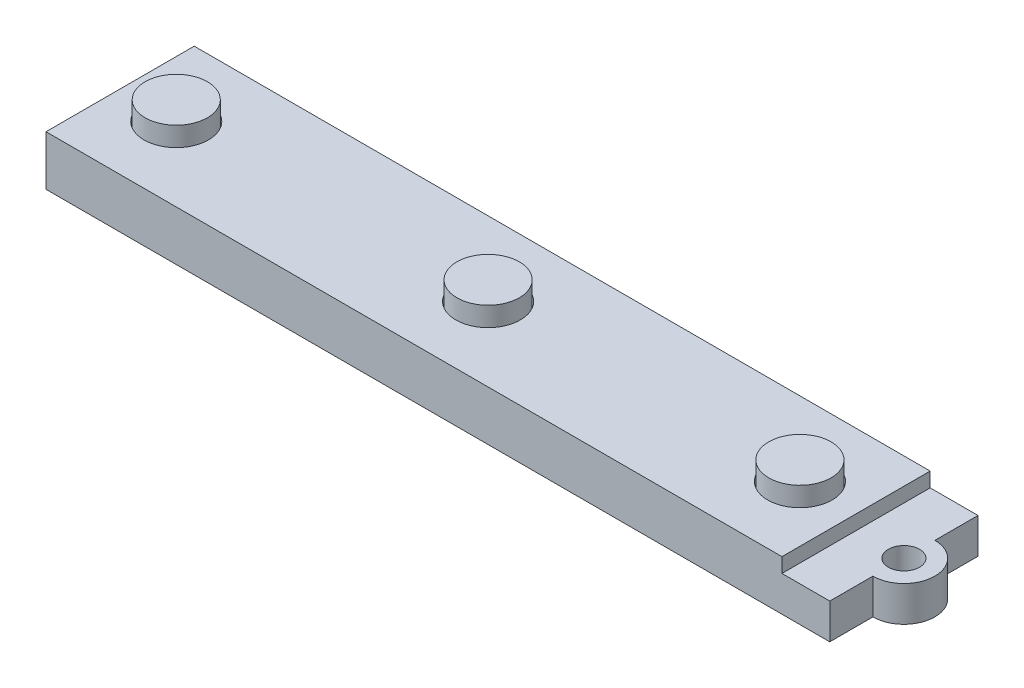
ISO-10303-21;
HEADER;
FILE_DESCRIPTION(('STEP AP214'),'2;1');
FILE_NAME('part.step','',(''),(''),'','','');
FILE_SCHEMA(('AUTOMOTIVE_DESIGN { 1 0 10303 214 1 1 1 1 }'));
ENDSEC;
DATA;
#1=APPLICATION_CONTEXT('core data for automotive mechanical design processes');
#2=APPLICATION_PROTOCOL_DEFINITION('international standard','automotive_design',2000,#1);
#3=PRODUCT_CONTEXT('',#1,'mechanical');
#4=PRODUCT('Part','Part','',(#3));
#5=PRODUCT_RELATED_PRODUCT_CATEGORY('part','',(#4));
#6=PRODUCT_DEFINITION_FORMATION('','',#4);
#7=PRODUCT_DEFINITION_CONTEXT('part definition',#1,'design');
#8=PRODUCT_DEFINITION('design','',#6,#7);
#9=PRODUCT_DEFINITION_SHAPE('','',#8);
#10=(LENGTH_UNIT() NAMED_UNIT(*) SI_UNIT(.MILLI.,.METRE.));
#11=(NAMED_UNIT(*) PLANE_ANGLE_UNIT() SI_UNIT($,.RADIAN.));
#12=(NAMED_UNIT(*) SI_UNIT($,.STERADIAN.) SOLID_ANGLE_UNIT());
#13=UNCERTAINTY_MEASURE_WITH_UNIT(LENGTH_MEASURE(1.E-05),#10,'distance_accuracy_value','');
#14=(GEOMETRIC_REPRESENTATION_CONTEXT(3) GLOBAL_UNCERTAINTY_ASSIGNED_CONTEXT((#13)) GLOBAL_UNIT_ASSIGNED_CONTEXT((#10,
#11,#12)) REPRESENTATION_CONTEXT('',''));
#15=CARTESIAN_POINT('',(0.,0.,0.));
#16=DIRECTION('',(0.,0.,1.));
#17=DIRECTION('',(1.,0.,0.));
#18=AXIS2_PLACEMENT_3D('',#15,#16,#17);
#19=CARTESIAN_POINT('',(0.,0.,0.));
#20=DIRECTION('',(0.,1.,0.));
#21=DIRECTION('',(0.,0.,1.));
#22=AXIS2_PLACEMENT_3D('',#19,#20,#21);
#23=PLANE('',#22);
#24=CARTESIAN_POINT('',(-20.4046666666667,0.,-25.8942737373737));
#25=DIRECTION('',(0.,1.,0.));
#26=DIRECTION('',(0.,0.,1.));
#27=AXIS2_PLACEMENT_3D('',#24,#25,#26);
#28=CIRCLE('',#27,1.905);
#29=CARTESIAN_POINT('',(-20.4046666666667,0.,-23.9892737373737));
#30=VERTEX_POINT('',#29);
#31=EDGE_CURVE('E212',#30,#30,#28,.T.);
#32=ORIENTED_EDGE('',*,*,#31,.T.);
#33=EDGE_LOOP('',(#32));
#34=FACE_BOUND('',#33,.T.);
#35=DIRECTION('',(0.,0.,-1.));
#36=VECTOR('',#35,1.);
#37=CARTESIAN_POINT('',(-112.479666666667,0.,-32.2442737373737));
#38=LINE('',#37,#36);
#39=CARTESIAN_POINT('',(-112.479666666667,0.,-19.5442737373737));
#40=VERTEX_POINT('',#39);
#41=CARTESIAN_POINT('',(-112.479666666667,0.,-32.2442737373737));
#42=VERTEX_POINT('',#41);
#43=EDGE_CURVE('E163',#40,#42,#38,.T.);
#44=ORIENTED_EDGE('',*,*,#43,.F.);
#45=DIRECTION('',(-1.,0.,0.));
#46=VECTOR('',#45,1.);
#47=CARTESIAN_POINT('',(-29.9296666666666,0.,-19.5442737373737));
#48=LINE('',#47,#46);
#49=CARTESIAN_POINT('',(-29.9296666666666,0.,-19.5442737373737));
#50=VERTEX_POINT('',#49);
#51=EDGE_CURVE('E168',#50,#40,#48,.T.);
#52=ORIENTED_EDGE('',*,*,#51,.F.);
#53=DIRECTION('',(0.,0.,1.));
#54=VECTOR('',#53,1.);
#55=CARTESIAN_POINT('',(-29.9296666666666,0.,-32.2442737373737));
#56=LINE('',#55,#54);
#57=CARTESIAN_POINT('',(-29.9296666666666,0.,-32.2442737373737));
#58=VERTEX_POINT('',#57);
#59=EDGE_CURVE('E178',#58,#50,#56,.T.);
#60=ORIENTED_EDGE('',*,*,#59,.F.);
#61=DIRECTION('',(1.,0.,0.));
#62=VECTOR('',#61,1.);
#63=CARTESIAN_POINT('',(-29.9296666666666,0.,-32.2442737373737));
#64=LINE('',#63,#62);
#65=EDGE_CURVE('E61',#42,#58,#64,.T.);
#66=ORIENTED_EDGE('',*,*,#65,.F.);
#67=EDGE_LOOP('',(#44,#52,#60,#66));
#68=FACE_BOUND('',#67,.T.);
#69=DIRECTION('',(-1.,0.,0.));
#70=VECTOR('',#69,1.);
#71=CARTESIAN_POINT('',(-116.162666666667,0.,-34.9493737373737));
#72=LINE('',#71,#70);
#73=CARTESIAN_POINT('',(-20.4046666666667,0.,-34.9493737373737));
#74=VERTEX_POINT('',#73);
#75=CARTESIAN_POINT('',(-116.162666666667,0.,-34.9493737373737));
#76=VERTEX_POINT('',#75);
#77=EDGE_CURVE('E234',#74,#76,#72,.T.);
#78=ORIENTED_EDGE('',*,*,#77,.F.);
#79=DIRECTION('',(0.,0.,1.));
#80=VECTOR('',#79,1.);
#81=CARTESIAN_POINT('',(-20.4046666666667,0.,0.));
#82=LINE('',#81,#80);
#83=CARTESIAN_POINT('',(-20.4046666666667,0.,-29.6800450522713));
#84=VERTEX_POINT('',#83);
#85=EDGE_CURVE('E160',#74,#84,#82,.T.);
#86=ORIENTED_EDGE('',*,*,#85,.T.);
#87=CARTESIAN_POINT('',(-20.4046666666667,0.,-25.8942737373737));
#88=DIRECTION('',(0.,1.,0.));
#89=DIRECTION('',(0.,0.,1.));
#90=AXIS2_PLACEMENT_3D('',#87,#88,#89);
#91=CIRCLE('',#90,3.78577131489756);
#92=CARTESIAN_POINT('',(-20.4046666666667,0.,-22.1085024224762));
#93=VERTEX_POINT('',#92);
#94=EDGE_CURVE('E156',#84,#93,#91,.F.);
#95=ORIENTED_EDGE('',*,*,#94,.T.);
#96=DIRECTION('',(0.,0.,1.));
#97=VECTOR('',#96,1.);
#98=CARTESIAN_POINT('',(-20.4046666666666,0.,0.));
#99=LINE('',#98,#97);
#100=CARTESIAN_POINT('',(-20.4046666666666,0.,-16.8391737373737));
#101=VERTEX_POINT('',#100);
#102=EDGE_CURVE('E134',#93,#101,#99,.T.);
#103=ORIENTED_EDGE('',*,*,#102,.T.);
#104=DIRECTION('',(1.,0.,0.));
#105=VECTOR('',#104,1.);
#106=CARTESIAN_POINT('',(-116.162666666667,0.,-16.8391737373737));
#107=LINE('',#106,#105);
#108=CARTESIAN_POINT('',(-116.162666666667,0.,-16.8391737373737));
#109=VERTEX_POINT('',#108);
#110=EDGE_CURVE('E241',#109,#101,#107,.T.);
#111=ORIENTED_EDGE('',*,*,#110,.F.);
#112=DIRECTION('',(0.,0.,1.));
#113=VECTOR('',#112,1.);
#114=CARTESIAN_POINT('',(-116.162666666667,0.,-34.9493737373737));
#115=LINE('',#114,#113);
#116=EDGE_CURVE('E227',#76,#109,#115,.T.);
#117=ORIENTED_EDGE('',*,*,#116,.F.);
#118=EDGE_LOOP('',(#78,#86,#95,#103,#111,#117));
#119=FACE_BOUND('',#118,.T.);
#120=ADVANCED_FACE('F38',(#34,#68,#119),#23,.F.);
#121=CARTESIAN_POINT('',(0.,4.318,0.));
#122=DIRECTION('',(0.,1.,0.));
#123=DIRECTION('',(0.,0.,1.));
#124=AXIS2_PLACEMENT_3D('',#121,#122,#123);
#125=PLANE('',#124);
#126=CARTESIAN_POINT('',(-20.4046666666667,4.318,-25.8942737373737));
#127=DIRECTION('',(0.,1.,0.));
#128=DIRECTION('',(0.,0.,1.));
#129=AXIS2_PLACEMENT_3D('',#126,#127,#128);
#130=CIRCLE('',#129,1.905);
#131=CARTESIAN_POINT('',(-20.4046666666667,4.318,-23.9892737373737));
#132=VERTEX_POINT('',#131);
#133=EDGE_CURVE('E209',#132,#132,#130,.T.);
#134=ORIENTED_EDGE('',*,*,#133,.F.);
#135=EDGE_LOOP('',(#134));
#136=FACE_BOUND('',#135,.T.);
#137=DIRECTION('',(0.,0.,1.));
#138=VECTOR('',#137,1.);
#139=CARTESIAN_POINT('',(-20.4046666666667,4.318,-34.9493737373737));
#140=LINE('',#139,#138);
#141=CARTESIAN_POINT('',(-20.4046666666667,4.318,-34.9493737373737));
#142=VERTEX_POINT('',#141);
#143=CARTESIAN_POINT('',(-20.4046666666667,4.318,-29.6800450522713));
#144=VERTEX_POINT('',#143);
#145=EDGE_CURVE('E53',#142,#144,#140,.T.);
#146=ORIENTED_EDGE('',*,*,#145,.F.);
#147=DIRECTION('',(-1.,0.,0.));
#148=VECTOR('',#147,1.);
#149=CARTESIAN_POINT('',(-26.2466666666667,4.318,-34.9493737373737));
#150=LINE('',#149,#148);
#151=CARTESIAN_POINT('',(-26.2466666666667,4.318,-34.9493737373737));
#152=VERTEX_POINT('',#151);
#153=EDGE_CURVE('E221',#142,#152,#150,.T.);
#154=ORIENTED_EDGE('',*,*,#153,.T.);
#155=DIRECTION('',(0.,0.,1.));
#156=VECTOR('',#155,1.);
#157=CARTESIAN_POINT('',(-26.2466666666667,4.318,-34.9493737373737));
#158=LINE('',#157,#156);
#159=CARTESIAN_POINT('',(-26.2466666666667,4.318,-16.8391737373737));
#160=VERTEX_POINT('',#159);
#161=EDGE_CURVE('E218',#152,#160,#158,.T.);
#162=ORIENTED_EDGE('',*,*,#161,.T.);
#163=DIRECTION('',(1.,0.,0.));
#164=VECTOR('',#163,1.);
#165=CARTESIAN_POINT('',(-26.2466666666667,4.318,-16.8391737373737));
#166=LINE('',#165,#164);
#167=CARTESIAN_POINT('',(-20.4046666666666,4.318,-16.8391737373737));
#168=VERTEX_POINT('',#167);
#169=EDGE_CURVE('E149',#160,#168,#166,.T.);
#170=ORIENTED_EDGE('',*,*,#169,.T.);
#171=DIRECTION('',(0.,0.,1.));
#172=VECTOR('',#171,1.);
#173=CARTESIAN_POINT('',(-20.4046666666667,4.318,-22.1085024224762));
#174=LINE('',#173,#172);
#175=CARTESIAN_POINT('',(-20.4046666666667,4.318,-22.1085024224762));
#176=VERTEX_POINT('',#175);
#177=EDGE_CURVE('E131',#176,#168,#174,.T.);
#178=ORIENTED_EDGE('',*,*,#177,.F.);
#179=CARTESIAN_POINT('',(-20.4046666666667,4.318,-25.8942737373737));
#180=DIRECTION('',(0.,-1.,0.));
#181=DIRECTION('',(0.,0.,1.));
#182=AXIS2_PLACEMENT_3D('',#179,#180,#181);
#183=CIRCLE('',#182,3.78577131489756);
#184=EDGE_CURVE('E141',#144,#176,#183,.T.);
#185=ORIENTED_EDGE('',*,*,#184,.F.);
#186=EDGE_LOOP('',(#146,#154,#162,#170,#178,#185));
#187=FACE_BOUND('',#186,.T.);
#188=ADVANCED_FACE('F146',(#136,#187),#125,.T.);
#189=CARTESIAN_POINT('',(-116.162666666667,6.096,-34.9493737373737));
#190=DIRECTION('',(1.,0.,0.));
#191=DIRECTION('',(0.,0.,-1.));
#192=AXIS2_PLACEMENT_3D('',#189,#190,#191);
#193=PLANE('',#192);
#194=ORIENTED_EDGE('',*,*,#116,.T.);
#195=DIRECTION('',(0.,-1.,0.));
#196=VECTOR('',#195,1.);
#197=CARTESIAN_POINT('',(-116.162666666667,6.096,-16.8391737373737));
#198=LINE('',#197,#196);
#199=CARTESIAN_POINT('',(-116.162666666667,6.096,-16.8391737373737));
#200=VERTEX_POINT('',#199);
#201=EDGE_CURVE('E11',#200,#109,#198,.T.);
#202=ORIENTED_EDGE('',*,*,#201,.F.);
#203=DIRECTION('',(0.,0.,1.));
#204=VECTOR('',#203,1.);
#205=CARTESIAN_POINT('',(-116.162666666667,6.096,-34.9493737373737));
#206=LINE('',#205,#204);
#207=CARTESIAN_POINT('',(-116.162666666667,6.096,-34.9493737373737));
#208=VERTEX_POINT('',#207);
#209=EDGE_CURVE('E230',#208,#200,#206,.T.);
#210=ORIENTED_EDGE('',*,*,#209,.F.);
#211=DIRECTION('',(0.,-1.,0.));
#212=VECTOR('',#211,1.);
#213=CARTESIAN_POINT('',(-116.162666666667,6.096,-34.9493737373737));
#214=LINE('',#213,#212);
#215=EDGE_CURVE('E46',#208,#76,#214,.T.);
#216=ORIENTED_EDGE('',*,*,#215,.T.);
#217=EDGE_LOOP('',(#194,#202,#210,#216));
#218=FACE_BOUND('',#217,.T.);
#219=ADVANCED_FACE('F40',(#218),#193,.F.);
#220=CARTESIAN_POINT('',(-116.162666666667,6.096,-16.8391737373737));
#221=DIRECTION('',(0.,0.,-1.));
#222=DIRECTION('',(-1.,0.,0.));
#223=AXIS2_PLACEMENT_3D('',#220,#221,#222);
#224=PLANE('',#223);
#225=ORIENTED_EDGE('',*,*,#110,.T.);
#226=DIRECTION('',(0.,1.,0.));
#227=VECTOR('',#226,1.);
#228=CARTESIAN_POINT('',(-20.4046666666666,-1.27,-16.8391737373737));
#229=LINE('',#228,#227);
#230=EDGE_CURVE('E137',#101,#168,#229,.T.);
#231=ORIENTED_EDGE('',*,*,#230,.T.);
#232=ORIENTED_EDGE('',*,*,#169,.F.);
#233=DIRECTION('',(0.,1.,0.));
#234=VECTOR('',#233,1.);
#235=CARTESIAN_POINT('',(-26.2466666666667,4.318,-16.8391737373737));
#236=LINE('',#235,#234);
#237=CARTESIAN_POINT('',(-26.2466666666667,6.096,-16.8391737373737));
#238=VERTEX_POINT('',#237);
#239=EDGE_CURVE('E223',#160,#238,#236,.T.);
#240=ORIENTED_EDGE('',*,*,#239,.T.);
#241=DIRECTION('',(1.,0.,0.));
#242=VECTOR('',#241,1.);
#243=CARTESIAN_POINT('',(-116.162666666667,6.096,-16.8391737373737));
#244=LINE('',#243,#242);
#245=EDGE_CURVE('E233',#200,#238,#244,.T.);
#246=ORIENTED_EDGE('',*,*,#245,.F.);
#247=ORIENTED_EDGE('',*,*,#201,.T.);
#248=EDGE_LOOP('',(#225,#231,#232,#240,#246,#247));
#249=FACE_BOUND('',#248,.T.);
#250=ADVANCED_FACE('F255',(#249),#224,.F.);
#251=CARTESIAN_POINT('',(-116.162666666667,6.096,-34.9493737373737));
#252=DIRECTION('',(0.,0.,1.));
#253=DIRECTION('',(1.,0.,0.));
#254=AXIS2_PLACEMENT_3D('',#251,#252,#253);
#255=PLANE('',#254);
#256=ORIENTED_EDGE('',*,*,#153,.F.);
#257=DIRECTION('',(0.,1.,0.));
#258=VECTOR('',#257,1.);
#259=CARTESIAN_POINT('',(-20.4046666666667,-1.27,-34.9493737373737));
#260=LINE('',#259,#258);
#261=EDGE_CURVE('E154',#74,#142,#260,.T.);
#262=ORIENTED_EDGE('',*,*,#261,.F.);
#263=ORIENTED_EDGE('',*,*,#77,.T.);
#264=ORIENTED_EDGE('',*,*,#215,.F.);
#265=DIRECTION('',(-1.,0.,0.));
#266=VECTOR('',#265,1.);
#267=CARTESIAN_POINT('',(-116.162666666667,6.096,-34.9493737373737));
#268=LINE('',#267,#266);
#269=CARTESIAN_POINT('',(-26.2466666666667,6.096,-34.9493737373737));
#270=VERTEX_POINT('',#269);
#271=EDGE_CURVE('E237',#270,#208,#268,.T.);
#272=ORIENTED_EDGE('',*,*,#271,.F.);
#273=DIRECTION('',(0.,1.,0.));
#274=VECTOR('',#273,1.);
#275=CARTESIAN_POINT('',(-26.2466666666667,4.318,-34.9493737373737));
#276=LINE('',#275,#274);
#277=EDGE_CURVE('E225',#152,#270,#276,.T.);
#278=ORIENTED_EDGE('',*,*,#277,.F.);
#279=EDGE_LOOP('',(#256,#262,#263,#264,#272,#278));
#280=FACE_BOUND('',#279,.T.);
#281=ADVANCED_FACE('F261',(#280),#255,.F.);
#282=CARTESIAN_POINT('',(0.,6.096,0.));
#283=DIRECTION('',(0.,1.,0.));
#284=DIRECTION('',(0.,0.,1.));
#285=AXIS2_PLACEMENT_3D('',#282,#283,#284);
#286=PLANE('',#285);
#287=CARTESIAN_POINT('',(-71.2046666666667,6.096,-25.8942737373734));
#288=DIRECTION('',(0.,1.,0.));
#289=DIRECTION('',(0.,0.,1.));
#290=AXIS2_PLACEMENT_3D('',#287,#288,#289);
#291=CIRCLE('',#290,3.937);
#292=CARTESIAN_POINT('',(-71.2046666666667,6.096,-21.9572737373734));
#293=VERTEX_POINT('',#292);
#294=EDGE_CURVE('E198',#293,#293,#291,.T.);
#295=ORIENTED_EDGE('',*,*,#294,.F.);
#296=EDGE_LOOP('',(#295));
#297=FACE_BOUND('',#296,.T.);
#298=CARTESIAN_POINT('',(-109.304666666667,6.096,-25.8942737373732));
#299=DIRECTION('',(0.,1.,0.));
#300=DIRECTION('',(0.,0.,1.));
#301=AXIS2_PLACEMENT_3D('',#298,#299,#300);
#302=CIRCLE('',#301,3.937);
#303=CARTESIAN_POINT('',(-109.304666666667,6.096,-21.9572737373732));
#304=VERTEX_POINT('',#303);
#305=EDGE_CURVE('E193',#304,#304,#302,.T.);
#306=ORIENTED_EDGE('',*,*,#305,.F.);
#307=EDGE_LOOP('',(#306));
#308=FACE_BOUND('',#307,.T.);
#309=CARTESIAN_POINT('',(-33.1046666666667,6.096,-25.8942737373737));
#310=DIRECTION('',(0.,1.,0.));
#311=DIRECTION('',(0.,0.,1.));
#312=AXIS2_PLACEMENT_3D('',#309,#310,#311);
#313=CIRCLE('',#312,3.937);
#314=CARTESIAN_POINT('',(-33.1046666666667,6.096,-21.9572737373737));
#315=VERTEX_POINT('',#314);
#316=EDGE_CURVE('E197',#315,#315,#313,.T.);
#317=ORIENTED_EDGE('',*,*,#316,.F.);
#318=EDGE_LOOP('',(#317));
#319=FACE_BOUND('',#318,.T.);
#320=DIRECTION('',(0.,0.,1.));
#321=VECTOR('',#320,1.);
#322=CARTESIAN_POINT('',(-26.2466666666667,6.096,-34.9493737373737));
#323=LINE('',#322,#321);
#324=EDGE_CURVE('E215',#270,#238,#323,.T.);
#325=ORIENTED_EDGE('',*,*,#324,.F.);
#326=ORIENTED_EDGE('',*,*,#271,.T.);
#327=ORIENTED_EDGE('',*,*,#209,.T.);
#328=ORIENTED_EDGE('',*,*,#245,.T.);
#329=EDGE_LOOP('',(#325,#326,#327,#328));
#330=FACE_BOUND('',#329,.T.);
#331=ADVANCED_FACE('F258',(#297,#308,#319,#330),#286,.T.);
#332=CARTESIAN_POINT('',(-26.2466666666667,4.318,-34.9493737373737));
#333=DIRECTION('',(-1.,0.,0.));
#334=DIRECTION('',(0.,0.,1.));
#335=AXIS2_PLACEMENT_3D('',#332,#333,#334);
#336=PLANE('',#335);
#337=ORIENTED_EDGE('',*,*,#324,.T.);
#338=ORIENTED_EDGE('',*,*,#239,.F.);
#339=ORIENTED_EDGE('',*,*,#161,.F.);
#340=ORIENTED_EDGE('',*,*,#277,.T.);
#341=EDGE_LOOP('',(#337,#338,#339,#340));
#342=FACE_BOUND('',#341,.T.);
#343=ADVANCED_FACE('F265',(#342),#336,.F.);
#344=CARTESIAN_POINT('',(-20.4046666666667,0.,-25.8942737373737));
#345=DIRECTION('',(0.,1.,0.));
#346=DIRECTION('',(0.,0.,1.));
#347=AXIS2_PLACEMENT_3D('',#344,#345,#346);
#348=CYLINDRICAL_SURFACE('',#347,1.905);
#349=ORIENTED_EDGE('',*,*,#31,.F.);
#350=EDGE_LOOP('',(#349));
#351=FACE_BOUND('',#350,.T.);
#352=ORIENTED_EDGE('',*,*,#133,.T.);
#353=EDGE_LOOP('',(#352));
#354=FACE_BOUND('',#353,.T.);
#355=ADVANCED_FACE('F317',(#351,#354),#348,.F.);
#356=CARTESIAN_POINT('',(-33.1046666666667,4.826,-25.8942737373737));
#357=DIRECTION('',(0.,1.,0.));
#358=DIRECTION('',(0.,0.,1.));
#359=AXIS2_PLACEMENT_3D('',#356,#357,#358);
#360=CYLINDRICAL_SURFACE('',#359,3.937);
#361=CARTESIAN_POINT('',(-33.1046666666667,4.826,-25.8942737373737));
#362=DIRECTION('',(0.,1.,0.));
#363=DIRECTION('',(0.,0.,1.));
#364=AXIS2_PLACEMENT_3D('',#361,#362,#363);
#365=CIRCLE('',#364,3.937);
#366=CARTESIAN_POINT('',(-33.1046666666667,4.826,-21.9572737373737));
#367=VERTEX_POINT('',#366);
#368=EDGE_CURVE('E206',#367,#367,#365,.T.);
#369=ORIENTED_EDGE('',*,*,#368,.F.);
#370=EDGE_LOOP('',(#369));
#371=FACE_BOUND('',#370,.T.);
#372=ORIENTED_EDGE('',*,*,#316,.T.);
#373=EDGE_LOOP('',(#372));
#374=FACE_BOUND('',#373,.T.);
#375=ADVANCED_FACE('F315',(#371,#374),#360,.F.);
#376=CARTESIAN_POINT('',(-33.1046666666667,4.826,-25.8942737373737));
#377=DIRECTION('',(0.,1.,0.));
#378=DIRECTION('',(0.,0.,1.));
#379=AXIS2_PLACEMENT_3D('',#376,#377,#378);
#380=PLANE('',#379);
#381=CARTESIAN_POINT('',(-33.1046666666667,4.826,-25.8942737373737));
#382=DIRECTION('',(0.,1.,0.));
#383=DIRECTION('',(0.,0.,1.));
#384=AXIS2_PLACEMENT_3D('',#381,#382,#383);
#385=CIRCLE('',#384,3.81);
#386=CARTESIAN_POINT('',(-33.1046666666667,4.826,-22.0842737373737));
#387=VERTEX_POINT('',#386);
#388=EDGE_CURVE('E268',#387,#387,#385,.T.);
#389=ORIENTED_EDGE('',*,*,#388,.F.);
#390=EDGE_LOOP('',(#389));
#391=FACE_BOUND('',#390,.T.);
#392=ORIENTED_EDGE('',*,*,#368,.T.);
#393=EDGE_LOOP('',(#392));
#394=FACE_BOUND('',#393,.T.);
#395=ADVANCED_FACE('F305',(#391,#394),#380,.T.);
#396=CARTESIAN_POINT('',(-109.304666666667,4.826,-25.8942737373732));
#397=DIRECTION('',(0.,1.,0.));
#398=DIRECTION('',(0.,0.,1.));
#399=AXIS2_PLACEMENT_3D('',#396,#397,#398);
#400=CYLINDRICAL_SURFACE('',#399,3.937);
#401=CARTESIAN_POINT('',(-109.304666666667,4.826,-25.8942737373732));
#402=DIRECTION('',(0.,1.,0.));
#403=DIRECTION('',(0.,0.,1.));
#404=AXIS2_PLACEMENT_3D('',#401,#402,#403);
#405=CIRCLE('',#404,3.937);
#406=CARTESIAN_POINT('',(-109.304666666667,4.826,-21.9572737373732));
#407=VERTEX_POINT('',#406);
#408=EDGE_CURVE('E201',#407,#407,#405,.T.);
#409=ORIENTED_EDGE('',*,*,#408,.F.);
#410=EDGE_LOOP('',(#409));
#411=FACE_BOUND('',#410,.T.);
#412=ORIENTED_EDGE('',*,*,#305,.T.);
#413=EDGE_LOOP('',(#412));
#414=FACE_BOUND('',#413,.T.);
#415=ADVANCED_FACE('F299',(#411,#414),#400,.F.);
#416=CARTESIAN_POINT('',(-109.304666666667,4.826,-25.8942737373732));
#417=DIRECTION('',(0.,1.,0.));
#418=DIRECTION('',(0.,0.,1.));
#419=AXIS2_PLACEMENT_3D('',#416,#417,#418);
#420=PLANE('',#419);
#421=CARTESIAN_POINT('',(-109.304666666667,4.826,-25.8942737373732));
#422=DIRECTION('',(0.,1.,0.));
#423=DIRECTION('',(0.,0.,1.));
#424=AXIS2_PLACEMENT_3D('',#421,#422,#423);
#425=CIRCLE('',#424,3.81);
#426=CARTESIAN_POINT('',(-109.304666666667,4.826,-22.0842737373732));
#427=VERTEX_POINT('',#426);
#428=EDGE_CURVE('E280',#427,#427,#425,.T.);
#429=ORIENTED_EDGE('',*,*,#428,.F.);
#430=EDGE_LOOP('',(#429));
#431=FACE_BOUND('',#430,.T.);
#432=ORIENTED_EDGE('',*,*,#408,.T.);
#433=EDGE_LOOP('',(#432));
#434=FACE_BOUND('',#433,.T.);
#435=ADVANCED_FACE('F295',(#431,#434),#420,.T.);
#436=CARTESIAN_POINT('',(-71.2046666666667,4.826,-25.8942737373734));
#437=DIRECTION('',(0.,1.,0.));
#438=DIRECTION('',(0.,0.,1.));
#439=AXIS2_PLACEMENT_3D('',#436,#437,#438);
#440=CYLINDRICAL_SURFACE('',#439,3.937);
#441=CARTESIAN_POINT('',(-71.2046666666667,4.826,-25.8942737373734));
#442=DIRECTION('',(0.,1.,0.));
#443=DIRECTION('',(0.,0.,1.));
#444=AXIS2_PLACEMENT_3D('',#441,#442,#443);
#445=CIRCLE('',#444,3.937);
#446=CARTESIAN_POINT('',(-71.2046666666667,4.826,-21.9572737373734));
#447=VERTEX_POINT('',#446);
#448=EDGE_CURVE('E194',#447,#447,#445,.T.);
#449=ORIENTED_EDGE('',*,*,#448,.F.);
#450=EDGE_LOOP('',(#449));
#451=FACE_BOUND('',#450,.T.);
#452=ORIENTED_EDGE('',*,*,#294,.T.);
#453=EDGE_LOOP('',(#452));
#454=FACE_BOUND('',#453,.T.);
#455=ADVANCED_FACE('F298',(#451,#454),#440,.F.);
#456=CARTESIAN_POINT('',(-71.2046666666667,4.826,-25.8942737373734));
#457=DIRECTION('',(0.,1.,0.));
#458=DIRECTION('',(0.,0.,1.));
#459=AXIS2_PLACEMENT_3D('',#456,#457,#458);
#460=PLANE('',#459);
#461=CARTESIAN_POINT('',(-71.2046666666667,4.826,-25.8942737373734));
#462=DIRECTION('',(0.,1.,0.));
#463=DIRECTION('',(0.,0.,1.));
#464=AXIS2_PLACEMENT_3D('',#461,#462,#463);
#465=CIRCLE('',#464,3.81000000000001);
#466=CARTESIAN_POINT('',(-71.2046666666667,4.826,-22.0842737373734));
#467=VERTEX_POINT('',#466);
#468=EDGE_CURVE('E274',#467,#467,#465,.T.);
#469=ORIENTED_EDGE('',*,*,#468,.F.);
#470=EDGE_LOOP('',(#469));
#471=FACE_BOUND('',#470,.T.);
#472=ORIENTED_EDGE('',*,*,#448,.T.);
#473=EDGE_LOOP('',(#472));
#474=FACE_BOUND('',#473,.T.);
#475=ADVANCED_FACE('F415',(#471,#474),#460,.T.);
#476=CARTESIAN_POINT('',(-112.479666666667,-1.27,-32.2442737373737));
#477=DIRECTION('',(1.,0.,0.));
#478=DIRECTION('',(0.,0.,-1.));
#479=AXIS2_PLACEMENT_3D('',#476,#477,#478);
#480=PLANE('',#479);
#481=ORIENTED_EDGE('',*,*,#43,.T.);
#482=DIRECTION('',(0.,1.,0.));
#483=VECTOR('',#482,1.);
#484=CARTESIAN_POINT('',(-112.479666666667,-1.27,-32.2442737373737));
#485=LINE('',#484,#483);
#486=CARTESIAN_POINT('',(-112.479666666667,-1.27,-32.2442737373737));
#487=VERTEX_POINT('',#486);
#488=EDGE_CURVE('E191',#487,#42,#485,.T.);
#489=ORIENTED_EDGE('',*,*,#488,.F.);
#490=DIRECTION('',(0.,0.,-1.));
#491=VECTOR('',#490,1.);
#492=CARTESIAN_POINT('',(-112.479666666667,-1.27,-32.2442737373737));
#493=LINE('',#492,#491);
#494=CARTESIAN_POINT('',(-112.479666666667,-1.27,-19.5442737373737));
#495=VERTEX_POINT('',#494);
#496=EDGE_CURVE('E164',#495,#487,#493,.T.);
#497=ORIENTED_EDGE('',*,*,#496,.F.);
#498=DIRECTION('',(0.,1.,0.));
#499=VECTOR('',#498,1.);
#500=CARTESIAN_POINT('',(-112.479666666667,-1.27,-19.5442737373737));
#501=LINE('',#500,#499);
#502=EDGE_CURVE('E174',#495,#40,#501,.T.);
#503=ORIENTED_EDGE('',*,*,#502,.T.);
#504=EDGE_LOOP('',(#481,#489,#497,#503));
#505=FACE_BOUND('',#504,.T.);
#506=ADVANCED_FACE('F404',(#505),#480,.F.);
#507=CARTESIAN_POINT('',(-29.9296666666666,-1.27,-32.2442737373737));
#508=DIRECTION('',(0.,0.,1.));
#509=DIRECTION('',(1.,0.,0.));
#510=AXIS2_PLACEMENT_3D('',#507,#508,#509);
#511=PLANE('',#510);
#512=ORIENTED_EDGE('',*,*,#65,.T.);
#513=DIRECTION('',(0.,1.,0.));
#514=VECTOR('',#513,1.);
#515=CARTESIAN_POINT('',(-29.9296666666666,-1.27,-32.2442737373737));
#516=LINE('',#515,#514);
#517=CARTESIAN_POINT('',(-29.9296666666666,-1.27,-32.2442737373737));
#518=VERTEX_POINT('',#517);
#519=EDGE_CURVE('E188',#518,#58,#516,.T.);
#520=ORIENTED_EDGE('',*,*,#519,.F.);
#521=DIRECTION('',(1.,0.,0.));
#522=VECTOR('',#521,1.);
#523=CARTESIAN_POINT('',(-29.9296666666666,-1.27,-32.2442737373737));
#524=LINE('',#523,#522);
#525=EDGE_CURVE('E167',#487,#518,#524,.T.);
#526=ORIENTED_EDGE('',*,*,#525,.F.);
#527=ORIENTED_EDGE('',*,*,#488,.T.);
#528=EDGE_LOOP('',(#512,#520,#526,#527));
#529=FACE_BOUND('',#528,.T.);
#530=ADVANCED_FACE('F393',(#529),#511,.F.);
#531=CARTESIAN_POINT('',(-29.9296666666666,-1.27,-32.2442737373737));
#532=DIRECTION('',(-1.,0.,0.));
#533=DIRECTION('',(0.,0.,1.));
#534=AXIS2_PLACEMENT_3D('',#531,#532,#533);
#535=PLANE('',#534);
#536=ORIENTED_EDGE('',*,*,#59,.T.);
#537=DIRECTION('',(0.,1.,0.));
#538=VECTOR('',#537,1.);
#539=CARTESIAN_POINT('',(-29.9296666666666,-1.27,-19.5442737373737));
#540=LINE('',#539,#538);
#541=CARTESIAN_POINT('',(-29.9296666666666,-1.27,-19.5442737373737));
#542=VERTEX_POINT('',#541);
#543=EDGE_CURVE('E185',#542,#50,#540,.T.);
#544=ORIENTED_EDGE('',*,*,#543,.F.);
#545=DIRECTION('',(0.,0.,1.));
#546=VECTOR('',#545,1.);
#547=CARTESIAN_POINT('',(-29.9296666666666,-1.27,-32.2442737373737));
#548=LINE('',#547,#546);
#549=EDGE_CURVE('E170',#518,#542,#548,.T.);
#550=ORIENTED_EDGE('',*,*,#549,.F.);
#551=ORIENTED_EDGE('',*,*,#519,.T.);
#552=EDGE_LOOP('',(#536,#544,#550,#551));
#553=FACE_BOUND('',#552,.T.);
#554=ADVANCED_FACE('F382',(#553),#535,.F.);
#555=CARTESIAN_POINT('',(-29.9296666666666,-1.27,-19.5442737373737));
#556=DIRECTION('',(0.,0.,-1.));
#557=DIRECTION('',(-1.,0.,0.));
#558=AXIS2_PLACEMENT_3D('',#555,#556,#557);
#559=PLANE('',#558);
#560=ORIENTED_EDGE('',*,*,#51,.T.);
#561=ORIENTED_EDGE('',*,*,#502,.F.);
#562=DIRECTION('',(-1.,0.,0.));
#563=VECTOR('',#562,1.);
#564=CARTESIAN_POINT('',(-29.9296666666666,-1.27,-19.5442737373737));
#565=LINE('',#564,#563);
#566=EDGE_CURVE('E172',#542,#495,#565,.T.);
#567=ORIENTED_EDGE('',*,*,#566,.F.);
#568=ORIENTED_EDGE('',*,*,#543,.T.);
#569=EDGE_LOOP('',(#560,#561,#567,#568));
#570=FACE_BOUND('',#569,.T.);
#571=ADVANCED_FACE('F370',(#570),#559,.F.);
#572=CARTESIAN_POINT('',(0.,-1.27,0.));
#573=DIRECTION('',(0.,-1.,0.));
#574=DIRECTION('',(0.,0.,-1.));
#575=AXIS2_PLACEMENT_3D('',#572,#573,#574);
#576=PLANE('',#575);
#577=ORIENTED_EDGE('',*,*,#496,.T.);
#578=ORIENTED_EDGE('',*,*,#525,.T.);
#579=ORIENTED_EDGE('',*,*,#549,.T.);
#580=ORIENTED_EDGE('',*,*,#566,.T.);
#581=EDGE_LOOP('',(#577,#578,#579,#580));
#582=FACE_BOUND('',#581,.T.);
#583=ADVANCED_FACE('F363',(#582),#576,.T.);
#584=CARTESIAN_POINT('',(-20.4046666666667,-1.27,-34.9493737373737));
#585=DIRECTION('',(-1.,0.,0.));
#586=DIRECTION('',(0.,0.,1.));
#587=AXIS2_PLACEMENT_3D('',#584,#585,#586);
#588=PLANE('',#587);
#589=ORIENTED_EDGE('',*,*,#261,.T.);
#590=ORIENTED_EDGE('',*,*,#145,.T.);
#591=DIRECTION('',(0.,1.,0.));
#592=VECTOR('',#591,1.);
#593=CARTESIAN_POINT('',(-20.4046666666667,-1.27,-29.6800450522713));
#594=LINE('',#593,#592);
#595=EDGE_CURVE('E138',#84,#144,#594,.T.);
#596=ORIENTED_EDGE('',*,*,#595,.F.);
#597=ORIENTED_EDGE('',*,*,#85,.F.);
#598=EDGE_LOOP('',(#589,#590,#596,#597));
#599=FACE_BOUND('',#598,.T.);
#600=ADVANCED_FACE('F369',(#599),#588,.F.);
#601=CARTESIAN_POINT('',(-20.4046666666667,-1.27,-22.1085024224762));
#602=DIRECTION('',(-1.,0.,0.));
#603=DIRECTION('',(0.,0.,1.));
#604=AXIS2_PLACEMENT_3D('',#601,#602,#603);
#605=PLANE('',#604);
#606=DIRECTION('',(0.,1.,0.));
#607=VECTOR('',#606,1.);
#608=CARTESIAN_POINT('',(-20.4046666666667,-1.27,-22.1085024224762));
#609=LINE('',#608,#607);
#610=EDGE_CURVE('E127',#93,#176,#609,.T.);
#611=ORIENTED_EDGE('',*,*,#610,.T.);
#612=ORIENTED_EDGE('',*,*,#177,.T.);
#613=ORIENTED_EDGE('',*,*,#230,.F.);
#614=ORIENTED_EDGE('',*,*,#102,.F.);
#615=EDGE_LOOP('',(#611,#612,#613,#614));
#616=FACE_BOUND('',#615,.T.);
#617=ADVANCED_FACE('F129',(#616),#605,.F.);
#618=CARTESIAN_POINT('',(-20.4046666666667,-1.27,-25.8942737373737));
#619=DIRECTION('',(0.,1.,0.));
#620=DIRECTION('',(0.,0.,1.));
#621=AXIS2_PLACEMENT_3D('',#618,#619,#620);
#622=CYLINDRICAL_SURFACE('',#621,3.78577131489756);
#623=ORIENTED_EDGE('',*,*,#595,.T.);
#624=ORIENTED_EDGE('',*,*,#184,.T.);
#625=ORIENTED_EDGE('',*,*,#610,.F.);
#626=ORIENTED_EDGE('',*,*,#94,.F.);
#627=EDGE_LOOP('',(#623,#624,#625,#626));
#628=FACE_BOUND('',#627,.T.);
#629=ADVANCED_FACE('F142',(#628),#622,.T.);
#630=CARTESIAN_POINT('',(-33.1046666666667,8.382,-25.8942737373737));
#631=DIRECTION('',(0.,-1.,0.));
#632=DIRECTION('',(0.,0.,-1.));
#633=AXIS2_PLACEMENT_3D('',#630,#631,#632);
#634=CYLINDRICAL_SURFACE('',#633,3.81);
#635=CARTESIAN_POINT('',(-33.1046666666667,8.382,-25.8942737373737));
#636=DIRECTION('',(0.,1.,0.));
#637=DIRECTION('',(0.,0.,1.));
#638=AXIS2_PLACEMENT_3D('',#635,#636,#637);
#639=CIRCLE('',#638,3.81);
#640=CARTESIAN_POINT('',(-33.1046666666667,8.382,-22.0842737373737));
#641=VERTEX_POINT('',#640);
#642=EDGE_CURVE('E266',#641,#641,#639,.T.);
#643=ORIENTED_EDGE('',*,*,#642,.F.);
#644=EDGE_LOOP('',(#643));
#645=FACE_BOUND('',#644,.T.);
#646=ORIENTED_EDGE('',*,*,#388,.T.);
#647=EDGE_LOOP('',(#646));
#648=FACE_BOUND('',#647,.T.);
#649=ADVANCED_FACE('F508',(#645,#648),#634,.T.);
#650=CARTESIAN_POINT('',(-33.1046666666667,8.382,-25.8942737373737));
#651=DIRECTION('',(0.,1.,0.));
#652=DIRECTION('',(0.,0.,1.));
#653=AXIS2_PLACEMENT_3D('',#650,#651,#652);
#654=PLANE('',#653);
#655=ORIENTED_EDGE('',*,*,#642,.T.);
#656=EDGE_LOOP('',(#655));
#657=FACE_BOUND('',#656,.T.);
#658=ADVANCED_FACE('F536',(#657),#654,.T.);
#659=CARTESIAN_POINT('',(-71.2046666666667,8.382,-25.8942737373734));
#660=DIRECTION('',(0.,-1.,0.));
#661=DIRECTION('',(0.,0.,-1.));
#662=AXIS2_PLACEMENT_3D('',#659,#660,#661);
#663=CYLINDRICAL_SURFACE('',#662,3.81000000000001);
#664=CARTESIAN_POINT('',(-71.2046666666667,8.382,-25.8942737373734));
#665=DIRECTION('',(0.,1.,0.));
#666=DIRECTION('',(0.,0.,1.));
#667=AXIS2_PLACEMENT_3D('',#664,#665,#666);
#668=CIRCLE('',#667,3.81000000000001);
#669=CARTESIAN_POINT('',(-71.2046666666667,8.382,-22.0842737373734));
#670=VERTEX_POINT('',#669);
#671=EDGE_CURVE('E272',#670,#670,#668,.T.);
#672=ORIENTED_EDGE('',*,*,#671,.F.);
#673=EDGE_LOOP('',(#672));
#674=FACE_BOUND('',#673,.T.);
#675=ORIENTED_EDGE('',*,*,#468,.T.);
#676=EDGE_LOOP('',(#675));
#677=FACE_BOUND('',#676,.T.);
#678=ADVANCED_FACE('F547',(#674,#677),#663,.T.);
#679=CARTESIAN_POINT('',(-71.2046666666667,8.382,-25.8942737373734));
#680=DIRECTION('',(0.,1.,0.));
#681=DIRECTION('',(0.,0.,1.));
#682=AXIS2_PLACEMENT_3D('',#679,#680,#681);
#683=PLANE('',#682);
#684=ORIENTED_EDGE('',*,*,#671,.T.);
#685=EDGE_LOOP('',(#684));
#686=FACE_BOUND('',#685,.T.);
#687=ADVANCED_FACE('F291',(#686),#683,.T.);
#688=CARTESIAN_POINT('',(-109.304666666667,8.382,-25.8942737373732));
#689=DIRECTION('',(0.,-1.,0.));
#690=DIRECTION('',(0.,0.,-1.));
#691=AXIS2_PLACEMENT_3D('',#688,#689,#690);
#692=CYLINDRICAL_SURFACE('',#691,3.81);
#693=CARTESIAN_POINT('',(-109.304666666667,8.382,-25.8942737373732));
#694=DIRECTION('',(0.,1.,0.));
#695=DIRECTION('',(0.,0.,1.));
#696=AXIS2_PLACEMENT_3D('',#693,#694,#695);
#697=CIRCLE('',#696,3.81);
#698=CARTESIAN_POINT('',(-109.304666666667,8.382,-22.0842737373732));
#699=VERTEX_POINT('',#698);
#700=EDGE_CURVE('E277',#699,#699,#697,.T.);
#701=ORIENTED_EDGE('',*,*,#700,.F.);
#702=EDGE_LOOP('',(#701));
#703=FACE_BOUND('',#702,.T.);
#704=ORIENTED_EDGE('',*,*,#428,.T.);
#705=EDGE_LOOP('',(#704));
#706=FACE_BOUND('',#705,.T.);
#707=ADVANCED_FACE('F288',(#703,#706),#692,.T.);
#708=CARTESIAN_POINT('',(-109.304666666667,8.382,-25.8942737373732));
#709=DIRECTION('',(0.,1.,0.));
#710=DIRECTION('',(0.,0.,1.));
#711=AXIS2_PLACEMENT_3D('',#708,#709,#710);
#712=PLANE('',#711);
#713=ORIENTED_EDGE('',*,*,#700,.T.);
#714=EDGE_LOOP('',(#713));
#715=FACE_BOUND('',#714,.T.);
#716=ADVANCED_FACE('F286',(#715),#712,.T.);
#717=CLOSED_SHELL('',(#120,#188,#219,#250,#281,#331,#343,#355,#375,#395,#415,#435,#455,#475,
#506,#530,#554,#571,#583,#600,#617,#629,#649,#658,#678,#687,#707,#716));
#718=MANIFOLD_SOLID_BREP('B2',#717);
#719=ADVANCED_BREP_SHAPE_REPRESENTATION('',(#18,#718),#14);
#720=SHAPE_DEFINITION_REPRESENTATION(#9,#719);
ENDSEC;
END-ISO-10303-21;
